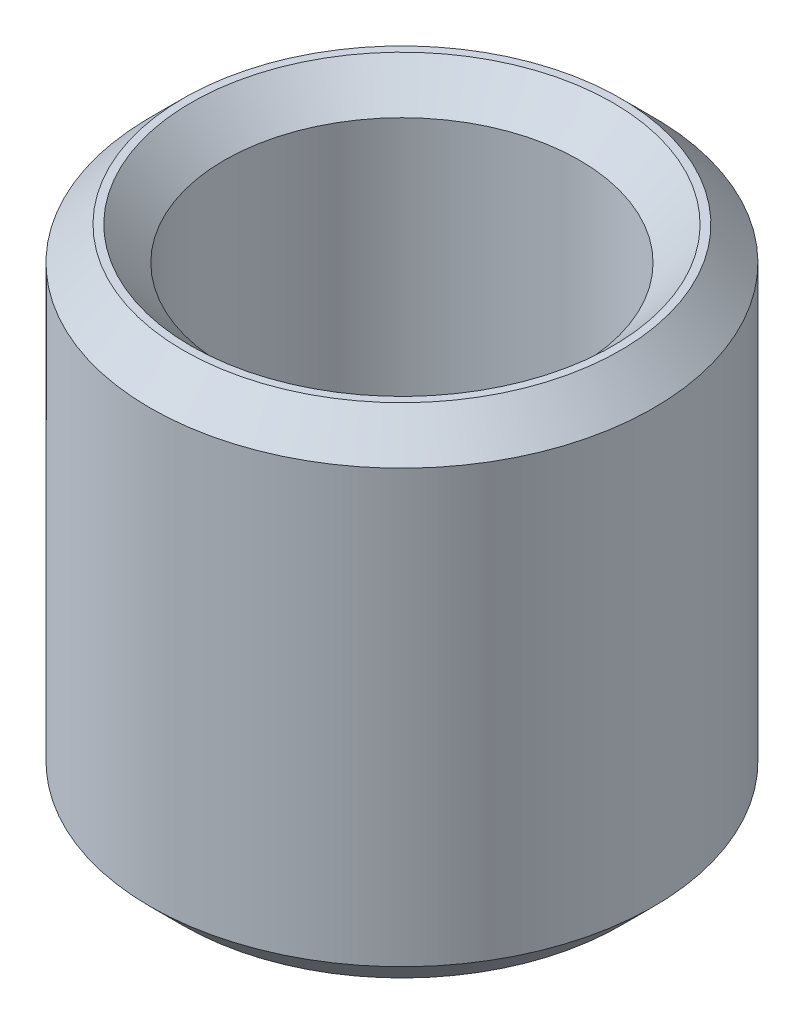
ISO-10303-21;
HEADER;
FILE_DESCRIPTION(('STEP AP214'),'2;1');
FILE_NAME('part.step','',(''),(''),'','','');
FILE_SCHEMA(('AUTOMOTIVE_DESIGN { 1 0 10303 214 1 1 1 1 }'));
ENDSEC;
DATA;
#1=APPLICATION_CONTEXT('core data for automotive mechanical design processes');
#2=APPLICATION_PROTOCOL_DEFINITION('international standard','automotive_design',2000,#1);
#3=PRODUCT_CONTEXT('',#1,'mechanical');
#4=PRODUCT('Part','Part','',(#3));
#5=PRODUCT_RELATED_PRODUCT_CATEGORY('part','',(#4));
#6=PRODUCT_DEFINITION_FORMATION('','',#4);
#7=PRODUCT_DEFINITION_CONTEXT('part definition',#1,'design');
#8=PRODUCT_DEFINITION('design','',#6,#7);
#9=PRODUCT_DEFINITION_SHAPE('','',#8);
#10=(LENGTH_UNIT() NAMED_UNIT(*) SI_UNIT(.MILLI.,.METRE.));
#11=(NAMED_UNIT(*) PLANE_ANGLE_UNIT() SI_UNIT($,.RADIAN.));
#12=(NAMED_UNIT(*) SI_UNIT($,.STERADIAN.) SOLID_ANGLE_UNIT());
#13=UNCERTAINTY_MEASURE_WITH_UNIT(LENGTH_MEASURE(1.E-05),#10,'distance_accuracy_value','');
#14=(GEOMETRIC_REPRESENTATION_CONTEXT(3) GLOBAL_UNCERTAINTY_ASSIGNED_CONTEXT((#13)) GLOBAL_UNIT_ASSIGNED_CONTEXT((#10,
#11,#12)) REPRESENTATION_CONTEXT('',''));
#15=CARTESIAN_POINT('',(0.,0.,0.));
#16=DIRECTION('',(0.,0.,1.));
#17=DIRECTION('',(1.,0.,0.));
#18=AXIS2_PLACEMENT_3D('',#15,#16,#17);
#19=CARTESIAN_POINT('',(0.,39.5851254325936,0.));
#20=DIRECTION('',(0.,-1.,0.));
#21=DIRECTION('',(0.,0.,-1.));
#22=AXIS2_PLACEMENT_3D('',#19,#20,#21);
#23=CYLINDRICAL_SURFACE('',#22,20.);
#24=CARTESIAN_POINT('',(0.,2.6412485063545,0.));
#25=DIRECTION('',(0.,1.,0.));
#26=DIRECTION('',(0.,0.,1.));
#27=AXIS2_PLACEMENT_3D('',#24,#25,#26);
#28=CIRCLE('',#27,20.);
#29=CARTESIAN_POINT('',(0.,2.6412485063545,20.));
#30=VERTEX_POINT('',#29);
#31=EDGE_CURVE('E10',#30,#30,#28,.T.);
#32=ORIENTED_EDGE('',*,*,#31,.T.);
#33=EDGE_LOOP('',(#32));
#34=FACE_BOUND('',#33,.T.);
#35=CARTESIAN_POINT('',(0.,36.9438769262391,0.));
#36=DIRECTION('',(0.,1.,0.));
#37=DIRECTION('',(0.,0.,1.));
#38=AXIS2_PLACEMENT_3D('',#35,#36,#37);
#39=CIRCLE('',#38,20.);
#40=CARTESIAN_POINT('',(0.,36.9438769262391,20.));
#41=VERTEX_POINT('',#40);
#42=EDGE_CURVE('E50',#41,#41,#39,.F.);
#43=ORIENTED_EDGE('',*,*,#42,.T.);
#44=EDGE_LOOP('',(#43));
#45=FACE_BOUND('',#44,.T.);
#46=ADVANCED_FACE('F39',(#34,#45),#23,.T.);
#47=CARTESIAN_POINT('',(0.,39.5851254325936,0.));
#48=DIRECTION('',(0.,1.,0.));
#49=DIRECTION('',(0.,0.,1.));
#50=AXIS2_PLACEMENT_3D('',#47,#48,#49);
#51=PLANE('',#50);
#52=CARTESIAN_POINT('',(0.,39.5851254325936,0.));
#53=DIRECTION('',(0.,1.,0.));
#54=DIRECTION('',(0.,0.,1.));
#55=AXIS2_PLACEMENT_3D('',#52,#53,#54);
#56=CIRCLE('',#55,16.7505364236782);
#57=CARTESIAN_POINT('',(0.,39.5851254325936,16.7505364236782));
#58=VERTEX_POINT('',#57);
#59=EDGE_CURVE('E58',#58,#58,#56,.F.);
#60=ORIENTED_EDGE('',*,*,#59,.T.);
#61=EDGE_LOOP('',(#60));
#62=FACE_BOUND('',#61,.T.);
#63=CARTESIAN_POINT('',(0.,39.5851254325936,0.));
#64=DIRECTION('',(0.,1.,0.));
#65=DIRECTION('',(0.,0.,1.));
#66=AXIS2_PLACEMENT_3D('',#63,#64,#65);
#67=CIRCLE('',#66,17.3587514936455);
#68=CARTESIAN_POINT('',(0.,39.5851254325936,17.3587514936455));
#69=VERTEX_POINT('',#68);
#70=EDGE_CURVE('E61',#69,#69,#67,.T.);
#71=ORIENTED_EDGE('',*,*,#70,.T.);
#72=EDGE_LOOP('',(#71));
#73=FACE_BOUND('',#72,.T.);
#74=ADVANCED_FACE('F88',(#62,#73),#51,.T.);
#75=CARTESIAN_POINT('',(0.,0.,0.));
#76=DIRECTION('',(0.,1.,0.));
#77=DIRECTION('',(0.,0.,1.));
#78=AXIS2_PLACEMENT_3D('',#75,#76,#77);
#79=PLANE('',#78);
#80=CARTESIAN_POINT('',(0.,0.,0.));
#81=DIRECTION('',(0.,1.,0.));
#82=DIRECTION('',(0.,0.,1.));
#83=AXIS2_PLACEMENT_3D('',#80,#81,#82);
#84=CIRCLE('',#83,16.7505364236782);
#85=CARTESIAN_POINT('',(0.,0.,16.7505364236782));
#86=VERTEX_POINT('',#85);
#87=EDGE_CURVE('E51',#86,#86,#84,.T.);
#88=ORIENTED_EDGE('',*,*,#87,.T.);
#89=EDGE_LOOP('',(#88));
#90=FACE_BOUND('',#89,.T.);
#91=CARTESIAN_POINT('',(0.,0.,0.));
#92=DIRECTION('',(0.,1.,0.));
#93=DIRECTION('',(0.,0.,1.));
#94=AXIS2_PLACEMENT_3D('',#91,#92,#93);
#95=CIRCLE('',#94,17.3587514936455);
#96=CARTESIAN_POINT('',(0.,0.,17.3587514936455));
#97=VERTEX_POINT('',#96);
#98=EDGE_CURVE('E54',#97,#97,#95,.F.);
#99=ORIENTED_EDGE('',*,*,#98,.T.);
#100=EDGE_LOOP('',(#99));
#101=FACE_BOUND('',#100,.T.);
#102=ADVANCED_FACE('F83',(#90,#101),#79,.F.);
#103=CARTESIAN_POINT('',(0.,39.5851254325936,0.));
#104=DIRECTION('',(0.,-1.,0.));
#105=DIRECTION('',(0.,0.,-1.));
#106=AXIS2_PLACEMENT_3D('',#103,#104,#105);
#107=CYLINDRICAL_SURFACE('',#106,14.1092879173237);
#108=CARTESIAN_POINT('',(0.,36.9438769262391,0.));
#109=DIRECTION('',(0.,1.,0.));
#110=DIRECTION('',(0.,0.,1.));
#111=AXIS2_PLACEMENT_3D('',#108,#109,#110);
#112=CIRCLE('',#111,14.1092879173237);
#113=CARTESIAN_POINT('',(0.,36.9438769262391,14.1092879173237));
#114=VERTEX_POINT('',#113);
#115=EDGE_CURVE('E67',#114,#114,#112,.T.);
#116=ORIENTED_EDGE('',*,*,#115,.T.);
#117=EDGE_LOOP('',(#116));
#118=FACE_BOUND('',#117,.T.);
#119=CARTESIAN_POINT('',(0.,2.64124850635453,0.));
#120=DIRECTION('',(0.,1.,0.));
#121=DIRECTION('',(0.,0.,1.));
#122=AXIS2_PLACEMENT_3D('',#119,#120,#121);
#123=CIRCLE('',#122,14.1092879173237);
#124=CARTESIAN_POINT('',(0.,2.64124850635453,14.1092879173237));
#125=VERTEX_POINT('',#124);
#126=EDGE_CURVE('E69',#125,#125,#123,.F.);
#127=ORIENTED_EDGE('',*,*,#126,.T.);
#128=EDGE_LOOP('',(#127));
#129=FACE_BOUND('',#128,.T.);
#130=ADVANCED_FACE('F71',(#118,#129),#107,.F.);
#131=CARTESIAN_POINT('',(0.,36.9438769262391,0.));
#132=DIRECTION('',(0.,1.,0.));
#133=DIRECTION('',(0.,0.,1.));
#134=AXIS2_PLACEMENT_3D('',#131,#132,#133);
#135=CONICAL_SURFACE('',#134,14.1092879173237,0.78539816339745);
#136=ORIENTED_EDGE('',*,*,#59,.F.);
#137=EDGE_LOOP('',(#136));
#138=FACE_BOUND('',#137,.T.);
#139=ORIENTED_EDGE('',*,*,#115,.F.);
#140=EDGE_LOOP('',(#139));
#141=FACE_BOUND('',#140,.T.);
#142=ADVANCED_FACE('F77',(#138,#141),#135,.F.);
#143=CARTESIAN_POINT('',(0.,0.,0.));
#144=DIRECTION('',(0.,-1.,0.));
#145=DIRECTION('',(0.,0.,-1.));
#146=AXIS2_PLACEMENT_3D('',#143,#144,#145);
#147=CONICAL_SURFACE('',#146,16.7505364236782,0.785398163397444);
#148=ORIENTED_EDGE('',*,*,#126,.F.);
#149=EDGE_LOOP('',(#148));
#150=FACE_BOUND('',#149,.T.);
#151=ORIENTED_EDGE('',*,*,#87,.F.);
#152=EDGE_LOOP('',(#151));
#153=FACE_BOUND('',#152,.T.);
#154=ADVANCED_FACE('F73',(#150,#153),#147,.F.);
#155=CARTESIAN_POINT('',(0.,2.6412485063545,0.));
#156=DIRECTION('',(0.,1.,0.));
#157=DIRECTION('',(0.,0.,1.));
#158=AXIS2_PLACEMENT_3D('',#155,#156,#157);
#159=CONICAL_SURFACE('',#158,20.,0.785398163397452);
#160=ORIENTED_EDGE('',*,*,#98,.F.);
#161=EDGE_LOOP('',(#160));
#162=FACE_BOUND('',#161,.T.);
#163=ORIENTED_EDGE('',*,*,#31,.F.);
#164=EDGE_LOOP('',(#163));
#165=FACE_BOUND('',#164,.T.);
#166=ADVANCED_FACE('F76',(#162,#165),#159,.T.);
#167=CARTESIAN_POINT('',(0.,39.5851254325936,0.));
#168=DIRECTION('',(0.,-1.,0.));
#169=DIRECTION('',(0.,0.,-1.));
#170=AXIS2_PLACEMENT_3D('',#167,#168,#169);
#171=CONICAL_SURFACE('',#170,17.3587514936455,0.785398163397444);
#172=ORIENTED_EDGE('',*,*,#42,.F.);
#173=EDGE_LOOP('',(#172));
#174=FACE_BOUND('',#173,.T.);
#175=ORIENTED_EDGE('',*,*,#70,.F.);
#176=EDGE_LOOP('',(#175));
#177=FACE_BOUND('',#176,.T.);
#178=ADVANCED_FACE('F45',(#174,#177),#171,.T.);
#179=CLOSED_SHELL('',(#46,#74,#102,#130,#142,#154,#166,#178));
#180=MANIFOLD_SOLID_BREP('B2',#179);
#181=ADVANCED_BREP_SHAPE_REPRESENTATION('',(#18,#180),#14);
#182=SHAPE_DEFINITION_REPRESENTATION(#9,#181);
ENDSEC;
END-ISO-10303-21;
